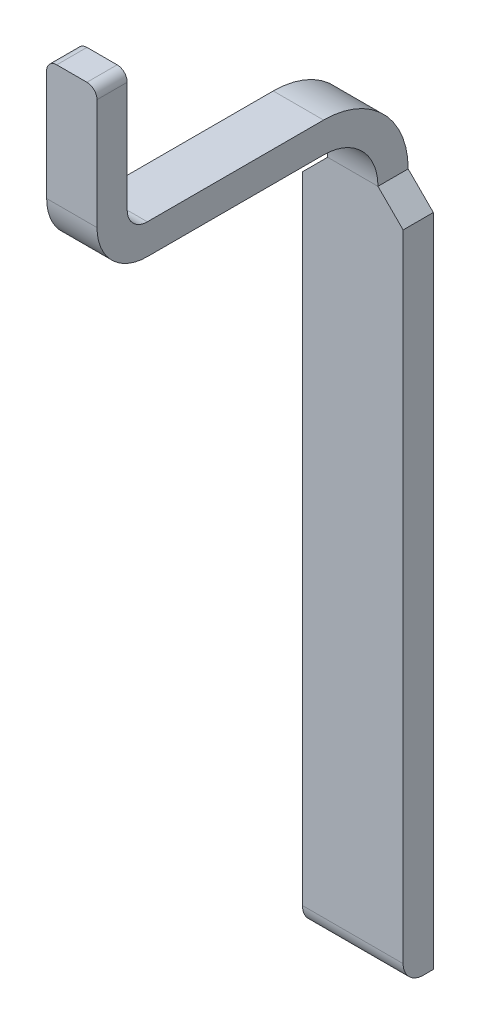
ISO-10303-21;
HEADER;
FILE_DESCRIPTION(('STEP AP214'),'2;1');
FILE_NAME('part.step','',(''),(''),'','','');
FILE_SCHEMA(('AUTOMOTIVE_DESIGN { 1 0 10303 214 1 1 1 1 }'));
ENDSEC;
DATA;
#1=APPLICATION_CONTEXT('core data for automotive mechanical design processes');
#2=APPLICATION_PROTOCOL_DEFINITION('international standard','automotive_design',2000,#1);
#3=PRODUCT_CONTEXT('',#1,'mechanical');
#4=PRODUCT('Part','Part','',(#3));
#5=PRODUCT_RELATED_PRODUCT_CATEGORY('part','',(#4));
#6=PRODUCT_DEFINITION_FORMATION('','',#4);
#7=PRODUCT_DEFINITION_CONTEXT('part definition',#1,'design');
#8=PRODUCT_DEFINITION('design','',#6,#7);
#9=PRODUCT_DEFINITION_SHAPE('','',#8);
#10=(LENGTH_UNIT() NAMED_UNIT(*) SI_UNIT(.MILLI.,.METRE.));
#11=(NAMED_UNIT(*) PLANE_ANGLE_UNIT() SI_UNIT($,.RADIAN.));
#12=(NAMED_UNIT(*) SI_UNIT($,.STERADIAN.) SOLID_ANGLE_UNIT());
#13=UNCERTAINTY_MEASURE_WITH_UNIT(LENGTH_MEASURE(1.E-05),#10,'distance_accuracy_value','');
#14=(GEOMETRIC_REPRESENTATION_CONTEXT(3) GLOBAL_UNCERTAINTY_ASSIGNED_CONTEXT((#13)) GLOBAL_UNIT_ASSIGNED_CONTEXT((#10,
#11,#12)) REPRESENTATION_CONTEXT('',''));
#15=CARTESIAN_POINT('',(0.,0.,0.));
#16=DIRECTION('',(0.,0.,1.));
#17=DIRECTION('',(1.,0.,0.));
#18=AXIS2_PLACEMENT_3D('',#15,#16,#17);
#19=CARTESIAN_POINT('',(0.25,2.03,-0.12));
#20=DIRECTION('',(0.,0.,-1.));
#21=DIRECTION('',(-1.,0.,0.));
#22=AXIS2_PLACEMENT_3D('',#19,#20,#21);
#23=PLANE('',#22);
#24=DIRECTION('',(0.,-1.,0.));
#25=VECTOR('',#24,1.);
#26=CARTESIAN_POINT('',(-0.25,2.03,-0.12));
#27=LINE('',#26,#25);
#28=CARTESIAN_POINT('',(-0.25,1.905,-0.12));
#29=VERTEX_POINT('',#28);
#30=CARTESIAN_POINT('',(-0.25,-1.25,-0.12));
#31=VERTEX_POINT('',#30);
#32=EDGE_CURVE('E11',#29,#31,#27,.T.);
#33=ORIENTED_EDGE('',*,*,#32,.T.);
#34=DIRECTION('',(1.,0.,0.));
#35=VECTOR('',#34,1.);
#36=CARTESIAN_POINT('',(0.25,-1.25,-0.12));
#37=LINE('',#36,#35);
#38=CARTESIAN_POINT('',(0.25,-1.25,-0.12));
#39=VERTEX_POINT('',#38);
#40=EDGE_CURVE('E277',#31,#39,#37,.T.);
#41=ORIENTED_EDGE('',*,*,#40,.T.);
#42=DIRECTION('',(0.,-1.,0.));
#43=VECTOR('',#42,1.);
#44=CARTESIAN_POINT('',(0.25,2.03,-0.12));
#45=LINE('',#44,#43);
#46=CARTESIAN_POINT('',(0.25,1.905,-0.12));
#47=VERTEX_POINT('',#46);
#48=EDGE_CURVE('E27',#47,#39,#45,.T.);
#49=ORIENTED_EDGE('',*,*,#48,.F.);
#50=DIRECTION('',(-0.707106781186547,0.707106781186548,0.));
#51=VECTOR('',#50,1.);
#52=CARTESIAN_POINT('',(0.25,1.905,-0.12));
#53=LINE('',#52,#51);
#54=CARTESIAN_POINT('',(0.125,2.03,-0.12));
#55=VERTEX_POINT('',#54);
#56=EDGE_CURVE('E289',#47,#55,#53,.T.);
#57=ORIENTED_EDGE('',*,*,#56,.T.);
#58=DIRECTION('',(-1.,0.,0.));
#59=VECTOR('',#58,1.);
#60=CARTESIAN_POINT('',(0.25,2.03,-0.12));
#61=LINE('',#60,#59);
#62=CARTESIAN_POINT('',(-0.125,2.03,-0.12));
#63=VERTEX_POINT('',#62);
#64=EDGE_CURVE('E157',#55,#63,#61,.T.);
#65=ORIENTED_EDGE('',*,*,#64,.T.);
#66=DIRECTION('',(-0.707106781186547,-0.707106781186548,0.));
#67=VECTOR('',#66,1.);
#68=CARTESIAN_POINT('',(-0.125,2.03,-0.12));
#69=LINE('',#68,#67);
#70=EDGE_CURVE('E303',#63,#29,#69,.T.);
#71=ORIENTED_EDGE('',*,*,#70,.T.);
#72=EDGE_LOOP('',(#33,#41,#49,#57,#65,#71));
#73=FACE_BOUND('',#72,.T.);
#74=ADVANCED_FACE('F16',(#73),#23,.F.);
#75=CARTESIAN_POINT('',(-0.25,-1.35,-0.27));
#76=DIRECTION('',(1.,0.,0.));
#77=DIRECTION('',(0.,-1.,0.));
#78=AXIS2_PLACEMENT_3D('',#75,#76,#77);
#79=PLANE('',#78);
#80=DIRECTION('',(0.,0.,-1.));
#81=VECTOR('',#80,1.);
#82=CARTESIAN_POINT('',(-0.25,-1.35,-0.12));
#83=LINE('',#82,#81);
#84=CARTESIAN_POINT('',(-0.25,-1.35,-0.22));
#85=VERTEX_POINT('',#84);
#86=CARTESIAN_POINT('',(-0.25,-1.35,-0.27));
#87=VERTEX_POINT('',#86);
#88=EDGE_CURVE('E232',#85,#87,#83,.T.);
#89=ORIENTED_EDGE('',*,*,#88,.F.);
#90=CARTESIAN_POINT('',(-0.25,-1.25,-0.22));
#91=DIRECTION('',(-1.,0.,0.));
#92=DIRECTION('',(0.,1.,0.));
#93=AXIS2_PLACEMENT_3D('',#90,#91,#92);
#94=CIRCLE('',#93,0.1);
#95=EDGE_CURVE('E273',#85,#31,#94,.T.);
#96=ORIENTED_EDGE('',*,*,#95,.T.);
#97=ORIENTED_EDGE('',*,*,#32,.F.);
#98=DIRECTION('',(0.,0.,-1.));
#99=VECTOR('',#98,1.);
#100=CARTESIAN_POINT('',(-0.25,1.905,-0.27));
#101=LINE('',#100,#99);
#102=CARTESIAN_POINT('',(-0.25,1.905,-0.27));
#103=VERTEX_POINT('',#102);
#104=EDGE_CURVE('E264',#29,#103,#101,.T.);
#105=ORIENTED_EDGE('',*,*,#104,.T.);
#106=DIRECTION('',(0.,1.,0.));
#107=VECTOR('',#106,1.);
#108=CARTESIAN_POINT('',(-0.25,-1.35,-0.27));
#109=LINE('',#108,#107);
#110=EDGE_CURVE('E189',#87,#103,#109,.T.);
#111=ORIENTED_EDGE('',*,*,#110,.F.);
#112=EDGE_LOOP('',(#89,#96,#97,#105,#111));
#113=FACE_BOUND('',#112,.T.);
#114=ADVANCED_FACE('F403',(#113),#79,.F.);
#115=CARTESIAN_POINT('',(0.25,-1.35,-0.27));
#116=DIRECTION('',(1.,0.,0.));
#117=DIRECTION('',(0.,-1.,0.));
#118=AXIS2_PLACEMENT_3D('',#115,#116,#117);
#119=PLANE('',#118);
#120=ORIENTED_EDGE('',*,*,#48,.T.);
#121=CARTESIAN_POINT('',(0.25,-1.25,-0.22));
#122=DIRECTION('',(1.,0.,0.));
#123=DIRECTION('',(0.,1.,0.));
#124=AXIS2_PLACEMENT_3D('',#121,#122,#123);
#125=CIRCLE('',#124,0.1);
#126=CARTESIAN_POINT('',(0.25,-1.35,-0.22));
#127=VERTEX_POINT('',#126);
#128=EDGE_CURVE('E299',#39,#127,#125,.T.);
#129=ORIENTED_EDGE('',*,*,#128,.T.);
#130=DIRECTION('',(0.,0.,-1.));
#131=VECTOR('',#130,1.);
#132=CARTESIAN_POINT('',(0.25,-1.35,-0.12));
#133=LINE('',#132,#131);
#134=CARTESIAN_POINT('',(0.25,-1.35,-0.27));
#135=VERTEX_POINT('',#134);
#136=EDGE_CURVE('E227',#127,#135,#133,.T.);
#137=ORIENTED_EDGE('',*,*,#136,.T.);
#138=DIRECTION('',(0.,1.,0.));
#139=VECTOR('',#138,1.);
#140=CARTESIAN_POINT('',(0.25,-1.35,-0.27));
#141=LINE('',#140,#139);
#142=CARTESIAN_POINT('',(0.25,1.905,-0.27));
#143=VERTEX_POINT('',#142);
#144=EDGE_CURVE('E260',#135,#143,#141,.T.);
#145=ORIENTED_EDGE('',*,*,#144,.T.);
#146=DIRECTION('',(0.,0.,1.));
#147=VECTOR('',#146,1.);
#148=CARTESIAN_POINT('',(0.25,1.905,-0.12));
#149=LINE('',#148,#147);
#150=EDGE_CURVE('E285',#143,#47,#149,.T.);
#151=ORIENTED_EDGE('',*,*,#150,.T.);
#152=EDGE_LOOP('',(#120,#129,#137,#145,#151));
#153=FACE_BOUND('',#152,.T.);
#154=ADVANCED_FACE('F377',(#153),#119,.T.);
#155=CARTESIAN_POINT('',(0.125,2.03,0.15));
#156=DIRECTION('',(1.,0.,0.));
#157=DIRECTION('',(0.,0.,1.));
#158=AXIS2_PLACEMENT_3D('',#155,#156,#157);
#159=CYLINDRICAL_SURFACE('',#158,0.27);
#160=CARTESIAN_POINT('',(-0.125,2.03,0.15));
#161=DIRECTION('',(1.,0.,0.));
#162=DIRECTION('',(0.,-1.,0.));
#163=AXIS2_PLACEMENT_3D('',#160,#161,#162);
#164=CIRCLE('',#163,0.27);
#165=CARTESIAN_POINT('',(-0.125,2.3,0.15));
#166=VERTEX_POINT('',#165);
#167=EDGE_CURVE('E149',#63,#166,#164,.T.);
#168=ORIENTED_EDGE('',*,*,#167,.F.);
#169=ORIENTED_EDGE('',*,*,#64,.F.);
#170=CARTESIAN_POINT('',(0.125,2.03,0.15));
#171=DIRECTION('',(1.,0.,0.));
#172=DIRECTION('',(0.,-1.,0.));
#173=AXIS2_PLACEMENT_3D('',#170,#171,#172);
#174=CIRCLE('',#173,0.27);
#175=CARTESIAN_POINT('',(0.125,2.3,0.15));
#176=VERTEX_POINT('',#175);
#177=EDGE_CURVE('E152',#55,#176,#174,.T.);
#178=ORIENTED_EDGE('',*,*,#177,.T.);
#179=DIRECTION('',(-1.,0.,0.));
#180=VECTOR('',#179,1.);
#181=CARTESIAN_POINT('',(0.125,2.3,0.15));
#182=LINE('',#181,#180);
#183=EDGE_CURVE('E144',#176,#166,#182,.T.);
#184=ORIENTED_EDGE('',*,*,#183,.T.);
#185=EDGE_LOOP('',(#168,#169,#178,#184));
#186=FACE_BOUND('',#185,.T.);
#187=ADVANCED_FACE('F146',(#186),#159,.F.);
#188=CARTESIAN_POINT('',(0.125,2.3,0.15));
#189=DIRECTION('',(0.,-1.,0.));
#190=DIRECTION('',(0.,0.,-1.));
#191=AXIS2_PLACEMENT_3D('',#188,#189,#190);
#192=PLANE('',#191);
#193=DIRECTION('',(0.,0.,1.));
#194=VECTOR('',#193,1.);
#195=CARTESIAN_POINT('',(-0.125,2.3,0.15));
#196=LINE('',#195,#194);
#197=CARTESIAN_POINT('',(-0.125,2.3,1.025));
#198=VERTEX_POINT('',#197);
#199=EDGE_CURVE('E161',#166,#198,#196,.T.);
#200=ORIENTED_EDGE('',*,*,#199,.F.);
#201=ORIENTED_EDGE('',*,*,#183,.F.);
#202=DIRECTION('',(0.,0.,1.));
#203=VECTOR('',#202,1.);
#204=CARTESIAN_POINT('',(0.125,2.3,0.15));
#205=LINE('',#204,#203);
#206=CARTESIAN_POINT('',(0.125,2.3,1.025));
#207=VERTEX_POINT('',#206);
#208=EDGE_CURVE('E284',#176,#207,#205,.T.);
#209=ORIENTED_EDGE('',*,*,#208,.T.);
#210=DIRECTION('',(-1.,0.,0.));
#211=VECTOR('',#210,1.);
#212=CARTESIAN_POINT('',(0.125,2.3,1.025));
#213=LINE('',#212,#211);
#214=EDGE_CURVE('E158',#207,#198,#213,.T.);
#215=ORIENTED_EDGE('',*,*,#214,.T.);
#216=EDGE_LOOP('',(#200,#201,#209,#215));
#217=FACE_BOUND('',#216,.T.);
#218=ADVANCED_FACE('F162',(#217),#192,.T.);
#219=CARTESIAN_POINT('',(0.125,2.55,1.025));
#220=DIRECTION('',(1.,0.,0.));
#221=DIRECTION('',(0.,0.,1.));
#222=AXIS2_PLACEMENT_3D('',#219,#220,#221);
#223=CYLINDRICAL_SURFACE('',#222,0.25);
#224=CARTESIAN_POINT('',(-0.125,2.55,1.025));
#225=DIRECTION('',(-1.,0.,0.));
#226=DIRECTION('',(0.,1.,0.));
#227=AXIS2_PLACEMENT_3D('',#224,#225,#226);
#228=CIRCLE('',#227,0.25);
#229=CARTESIAN_POINT('',(-0.125,2.55,1.275));
#230=VERTEX_POINT('',#229);
#231=EDGE_CURVE('E167',#198,#230,#228,.T.);
#232=ORIENTED_EDGE('',*,*,#231,.F.);
#233=ORIENTED_EDGE('',*,*,#214,.F.);
#234=CARTESIAN_POINT('',(0.125,2.55,1.025));
#235=DIRECTION('',(-1.,0.,0.));
#236=DIRECTION('',(0.,1.,0.));
#237=AXIS2_PLACEMENT_3D('',#234,#235,#236);
#238=CIRCLE('',#237,0.25);
#239=CARTESIAN_POINT('',(0.125,2.55,1.275));
#240=VERTEX_POINT('',#239);
#241=EDGE_CURVE('E241',#207,#240,#238,.T.);
#242=ORIENTED_EDGE('',*,*,#241,.T.);
#243=DIRECTION('',(-1.,0.,0.));
#244=VECTOR('',#243,1.);
#245=CARTESIAN_POINT('',(0.125,2.55,1.275));
#246=LINE('',#245,#244);
#247=EDGE_CURVE('E245',#240,#230,#246,.T.);
#248=ORIENTED_EDGE('',*,*,#247,.T.);
#249=EDGE_LOOP('',(#232,#233,#242,#248));
#250=FACE_BOUND('',#249,.T.);
#251=ADVANCED_FACE('F595',(#250),#223,.T.);
#252=CARTESIAN_POINT('',(0.125,2.55,1.275));
#253=DIRECTION('',(0.,0.,1.));
#254=DIRECTION('',(0.,-1.,0.));
#255=AXIS2_PLACEMENT_3D('',#252,#253,#254);
#256=PLANE('',#255);
#257=DIRECTION('',(0.,1.,0.));
#258=VECTOR('',#257,1.);
#259=CARTESIAN_POINT('',(0.125,2.55,1.275));
#260=LINE('',#259,#258);
#261=CARTESIAN_POINT('',(0.125,3.1,1.275));
#262=VERTEX_POINT('',#261);
#263=EDGE_CURVE('E238',#240,#262,#260,.T.);
#264=ORIENTED_EDGE('',*,*,#263,.T.);
#265=CARTESIAN_POINT('',(0.075,3.1,1.275));
#266=DIRECTION('',(0.,0.,1.));
#267=DIRECTION('',(0.,-1.,0.));
#268=AXIS2_PLACEMENT_3D('',#265,#266,#267);
#269=CIRCLE('',#268,0.05);
#270=CARTESIAN_POINT('',(0.075,3.15,1.275));
#271=VERTEX_POINT('',#270);
#272=EDGE_CURVE('E233',#262,#271,#269,.T.);
#273=ORIENTED_EDGE('',*,*,#272,.T.);
#274=DIRECTION('',(-1.,0.,0.));
#275=VECTOR('',#274,1.);
#276=CARTESIAN_POINT('',(0.125,3.15,1.275));
#277=LINE('',#276,#275);
#278=CARTESIAN_POINT('',(-0.075,3.15,1.275));
#279=VERTEX_POINT('',#278);
#280=EDGE_CURVE('E222',#271,#279,#277,.T.);
#281=ORIENTED_EDGE('',*,*,#280,.T.);
#282=CARTESIAN_POINT('',(-0.075,3.1,1.275));
#283=DIRECTION('',(0.,0.,1.));
#284=DIRECTION('',(0.,-1.,0.));
#285=AXIS2_PLACEMENT_3D('',#282,#283,#284);
#286=CIRCLE('',#285,0.05);
#287=CARTESIAN_POINT('',(-0.125,3.1,1.275));
#288=VERTEX_POINT('',#287);
#289=EDGE_CURVE('E218',#279,#288,#286,.T.);
#290=ORIENTED_EDGE('',*,*,#289,.T.);
#291=DIRECTION('',(0.,1.,0.));
#292=VECTOR('',#291,1.);
#293=CARTESIAN_POINT('',(-0.125,2.55,1.275));
#294=LINE('',#293,#292);
#295=EDGE_CURVE('E197',#230,#288,#294,.T.);
#296=ORIENTED_EDGE('',*,*,#295,.F.);
#297=ORIENTED_EDGE('',*,*,#247,.F.);
#298=EDGE_LOOP('',(#264,#273,#281,#290,#296,#297));
#299=FACE_BOUND('',#298,.T.);
#300=ADVANCED_FACE('F587',(#299),#256,.T.);
#301=CARTESIAN_POINT('',(0.125,3.15,1.275));
#302=DIRECTION('',(0.,1.,0.));
#303=DIRECTION('',(1.,0.,0.));
#304=AXIS2_PLACEMENT_3D('',#301,#302,#303);
#305=PLANE('',#304);
#306=ORIENTED_EDGE('',*,*,#280,.F.);
#307=DIRECTION('',(0.,0.,-1.));
#308=VECTOR('',#307,1.);
#309=CARTESIAN_POINT('',(0.075,3.15,1.275));
#310=LINE('',#309,#308);
#311=CARTESIAN_POINT('',(0.075,3.15,1.125));
#312=VERTEX_POINT('',#311);
#313=EDGE_CURVE('E224',#271,#312,#310,.T.);
#314=ORIENTED_EDGE('',*,*,#313,.T.);
#315=DIRECTION('',(-1.,0.,0.));
#316=VECTOR('',#315,1.);
#317=CARTESIAN_POINT('',(0.125,3.15,1.125));
#318=LINE('',#317,#316);
#319=CARTESIAN_POINT('',(-0.075,3.15,1.125));
#320=VERTEX_POINT('',#319);
#321=EDGE_CURVE('E328',#312,#320,#318,.T.);
#322=ORIENTED_EDGE('',*,*,#321,.T.);
#323=DIRECTION('',(0.,0.,1.));
#324=VECTOR('',#323,1.);
#325=CARTESIAN_POINT('',(-0.075,3.15,1.275));
#326=LINE('',#325,#324);
#327=EDGE_CURVE('E209',#320,#279,#326,.T.);
#328=ORIENTED_EDGE('',*,*,#327,.T.);
#329=EDGE_LOOP('',(#306,#314,#322,#328));
#330=FACE_BOUND('',#329,.T.);
#331=ADVANCED_FACE('F580',(#330),#305,.T.);
#332=CARTESIAN_POINT('',(0.125,2.55,1.125));
#333=DIRECTION('',(0.,0.,-1.));
#334=DIRECTION('',(0.,-1.,0.));
#335=AXIS2_PLACEMENT_3D('',#332,#333,#334);
#336=PLANE('',#335);
#337=ORIENTED_EDGE('',*,*,#321,.F.);
#338=CARTESIAN_POINT('',(0.075,3.1,1.125));
#339=DIRECTION('',(0.,0.,-1.));
#340=DIRECTION('',(0.,1.,0.));
#341=AXIS2_PLACEMENT_3D('',#338,#339,#340);
#342=CIRCLE('',#341,0.05);
#343=CARTESIAN_POINT('',(0.125,3.1,1.125));
#344=VERTEX_POINT('',#343);
#345=EDGE_CURVE('E228',#312,#344,#342,.T.);
#346=ORIENTED_EDGE('',*,*,#345,.T.);
#347=DIRECTION('',(0.,-1.,0.));
#348=VECTOR('',#347,1.);
#349=CARTESIAN_POINT('',(0.125,2.55,1.125));
#350=LINE('',#349,#348);
#351=CARTESIAN_POINT('',(0.125,2.55,1.125));
#352=VERTEX_POINT('',#351);
#353=EDGE_CURVE('E242',#344,#352,#350,.T.);
#354=ORIENTED_EDGE('',*,*,#353,.T.);
#355=DIRECTION('',(-1.,0.,0.));
#356=VECTOR('',#355,1.);
#357=CARTESIAN_POINT('',(0.125,2.55,1.125));
#358=LINE('',#357,#356);
#359=CARTESIAN_POINT('',(-0.125,2.55,1.125));
#360=VERTEX_POINT('',#359);
#361=EDGE_CURVE('E314',#352,#360,#358,.T.);
#362=ORIENTED_EDGE('',*,*,#361,.T.);
#363=DIRECTION('',(0.,-1.,0.));
#364=VECTOR('',#363,1.);
#365=CARTESIAN_POINT('',(-0.125,2.55,1.125));
#366=LINE('',#365,#364);
#367=CARTESIAN_POINT('',(-0.125,3.1,1.125));
#368=VERTEX_POINT('',#367);
#369=EDGE_CURVE('E205',#368,#360,#366,.T.);
#370=ORIENTED_EDGE('',*,*,#369,.F.);
#371=CARTESIAN_POINT('',(-0.075,3.1,1.125));
#372=DIRECTION('',(0.,0.,-1.));
#373=DIRECTION('',(0.,1.,0.));
#374=AXIS2_PLACEMENT_3D('',#371,#372,#373);
#375=CIRCLE('',#374,0.05);
#376=EDGE_CURVE('E198',#368,#320,#375,.T.);
#377=ORIENTED_EDGE('',*,*,#376,.T.);
#378=EDGE_LOOP('',(#337,#346,#354,#362,#370,#377));
#379=FACE_BOUND('',#378,.T.);
#380=ADVANCED_FACE('F573',(#379),#336,.T.);
#381=CARTESIAN_POINT('',(0.125,2.55,1.025));
#382=DIRECTION('',(1.,0.,0.));
#383=DIRECTION('',(0.,0.,1.));
#384=AXIS2_PLACEMENT_3D('',#381,#382,#383);
#385=CYLINDRICAL_SURFACE('',#384,0.1);
#386=CARTESIAN_POINT('',(-0.125,2.55,1.025));
#387=DIRECTION('',(1.,0.,0.));
#388=DIRECTION('',(0.,1.,0.));
#389=AXIS2_PLACEMENT_3D('',#386,#387,#388);
#390=CIRCLE('',#389,0.1);
#391=CARTESIAN_POINT('',(-0.125,2.45,1.025));
#392=VERTEX_POINT('',#391);
#393=EDGE_CURVE('E251',#360,#392,#390,.T.);
#394=ORIENTED_EDGE('',*,*,#393,.F.);
#395=ORIENTED_EDGE('',*,*,#361,.F.);
#396=CARTESIAN_POINT('',(0.125,2.55,1.025));
#397=DIRECTION('',(1.,0.,0.));
#398=DIRECTION('',(0.,1.,0.));
#399=AXIS2_PLACEMENT_3D('',#396,#397,#398);
#400=CIRCLE('',#399,0.1);
#401=CARTESIAN_POINT('',(0.125,2.45,1.025));
#402=VERTEX_POINT('',#401);
#403=EDGE_CURVE('E255',#352,#402,#400,.T.);
#404=ORIENTED_EDGE('',*,*,#403,.T.);
#405=DIRECTION('',(-1.,0.,0.));
#406=VECTOR('',#405,1.);
#407=CARTESIAN_POINT('',(0.125,2.45,1.025));
#408=LINE('',#407,#406);
#409=EDGE_CURVE('E41',#402,#392,#408,.T.);
#410=ORIENTED_EDGE('',*,*,#409,.T.);
#411=EDGE_LOOP('',(#394,#395,#404,#410));
#412=FACE_BOUND('',#411,.T.);
#413=ADVANCED_FACE('F18',(#412),#385,.F.);
#414=CARTESIAN_POINT('',(0.125,2.45,0.15));
#415=DIRECTION('',(0.,1.,0.));
#416=DIRECTION('',(1.,0.,0.));
#417=AXIS2_PLACEMENT_3D('',#414,#415,#416);
#418=PLANE('',#417);
#419=DIRECTION('',(0.,0.,-1.));
#420=VECTOR('',#419,1.);
#421=CARTESIAN_POINT('',(-0.125,2.45,0.15));
#422=LINE('',#421,#420);
#423=CARTESIAN_POINT('',(-0.125,2.45,0.15));
#424=VERTEX_POINT('',#423);
#425=EDGE_CURVE('E180',#392,#424,#422,.T.);
#426=ORIENTED_EDGE('',*,*,#425,.F.);
#427=ORIENTED_EDGE('',*,*,#409,.F.);
#428=DIRECTION('',(0.,0.,-1.));
#429=VECTOR('',#428,1.);
#430=CARTESIAN_POINT('',(0.125,2.45,0.15));
#431=LINE('',#430,#429);
#432=CARTESIAN_POINT('',(0.125,2.45,0.15));
#433=VERTEX_POINT('',#432);
#434=EDGE_CURVE('E252',#402,#433,#431,.T.);
#435=ORIENTED_EDGE('',*,*,#434,.T.);
#436=DIRECTION('',(-1.,0.,0.));
#437=VECTOR('',#436,1.);
#438=CARTESIAN_POINT('',(0.125,2.45,0.15));
#439=LINE('',#438,#437);
#440=EDGE_CURVE('E292',#433,#424,#439,.T.);
#441=ORIENTED_EDGE('',*,*,#440,.T.);
#442=EDGE_LOOP('',(#426,#427,#435,#441));
#443=FACE_BOUND('',#442,.T.);
#444=ADVANCED_FACE('F561',(#443),#418,.T.);
#445=CARTESIAN_POINT('',(0.125,2.03,0.15));
#446=DIRECTION('',(1.,0.,0.));
#447=DIRECTION('',(0.,-1.,0.));
#448=AXIS2_PLACEMENT_3D('',#445,#446,#447);
#449=PLANE('',#448);
#450=ORIENTED_EDGE('',*,*,#353,.F.);
#451=DIRECTION('',(0.,0.,1.));
#452=VECTOR('',#451,1.);
#453=CARTESIAN_POINT('',(0.125,3.1,0.15));
#454=LINE('',#453,#452);
#455=EDGE_CURVE('E20',#344,#262,#454,.T.);
#456=ORIENTED_EDGE('',*,*,#455,.T.);
#457=ORIENTED_EDGE('',*,*,#263,.F.);
#458=ORIENTED_EDGE('',*,*,#241,.F.);
#459=ORIENTED_EDGE('',*,*,#208,.F.);
#460=ORIENTED_EDGE('',*,*,#177,.F.);
#461=DIRECTION('',(0.,0.,-1.));
#462=VECTOR('',#461,1.);
#463=CARTESIAN_POINT('',(0.125,2.03,-0.27));
#464=LINE('',#463,#462);
#465=CARTESIAN_POINT('',(0.125,2.03,-0.27));
#466=VERTEX_POINT('',#465);
#467=EDGE_CURVE('E184',#55,#466,#464,.T.);
#468=ORIENTED_EDGE('',*,*,#467,.T.);
#469=CARTESIAN_POINT('',(0.125,2.03,0.15));
#470=DIRECTION('',(-1.,0.,0.));
#471=DIRECTION('',(0.,-1.,0.));
#472=AXIS2_PLACEMENT_3D('',#469,#470,#471);
#473=CIRCLE('',#472,0.42);
#474=EDGE_CURVE('E295',#433,#466,#473,.T.);
#475=ORIENTED_EDGE('',*,*,#474,.F.);
#476=ORIENTED_EDGE('',*,*,#434,.F.);
#477=ORIENTED_EDGE('',*,*,#403,.F.);
#478=EDGE_LOOP('',(#450,#456,#457,#458,#459,#460,#468,#475,#476,#477));
#479=FACE_BOUND('',#478,.T.);
#480=ADVANCED_FACE('F353',(#479),#449,.T.);
#481=CARTESIAN_POINT('',(0.125,2.03,0.15));
#482=DIRECTION('',(1.,0.,0.));
#483=DIRECTION('',(0.,0.,1.));
#484=AXIS2_PLACEMENT_3D('',#481,#482,#483);
#485=CYLINDRICAL_SURFACE('',#484,0.42);
#486=CARTESIAN_POINT('',(-0.125,2.03,0.15));
#487=DIRECTION('',(-1.,0.,0.));
#488=DIRECTION('',(0.,-1.,0.));
#489=AXIS2_PLACEMENT_3D('',#486,#487,#488);
#490=CIRCLE('',#489,0.42);
#491=CARTESIAN_POINT('',(-0.125,2.03,-0.27));
#492=VERTEX_POINT('',#491);
#493=EDGE_CURVE('E174',#424,#492,#490,.T.);
#494=ORIENTED_EDGE('',*,*,#493,.F.);
#495=ORIENTED_EDGE('',*,*,#440,.F.);
#496=ORIENTED_EDGE('',*,*,#474,.T.);
#497=DIRECTION('',(-1.,0.,0.));
#498=VECTOR('',#497,1.);
#499=CARTESIAN_POINT('',(0.25,2.03,-0.27));
#500=LINE('',#499,#498);
#501=EDGE_CURVE('E188',#466,#492,#500,.T.);
#502=ORIENTED_EDGE('',*,*,#501,.T.);
#503=EDGE_LOOP('',(#494,#495,#496,#502));
#504=FACE_BOUND('',#503,.T.);
#505=ADVANCED_FACE('F366',(#504),#485,.T.);
#506=CARTESIAN_POINT('',(-0.125,2.03,0.15));
#507=DIRECTION('',(1.,0.,0.));
#508=DIRECTION('',(0.,-1.,0.));
#509=AXIS2_PLACEMENT_3D('',#506,#507,#508);
#510=PLANE('',#509);
#511=ORIENTED_EDGE('',*,*,#295,.T.);
#512=DIRECTION('',(0.,0.,-1.));
#513=VECTOR('',#512,1.);
#514=CARTESIAN_POINT('',(-0.125,3.1,1.125));
#515=LINE('',#514,#513);
#516=EDGE_CURVE('E194',#288,#368,#515,.T.);
#517=ORIENTED_EDGE('',*,*,#516,.T.);
#518=ORIENTED_EDGE('',*,*,#369,.T.);
#519=ORIENTED_EDGE('',*,*,#393,.T.);
#520=ORIENTED_EDGE('',*,*,#425,.T.);
#521=ORIENTED_EDGE('',*,*,#493,.T.);
#522=DIRECTION('',(0.,0.,1.));
#523=VECTOR('',#522,1.);
#524=CARTESIAN_POINT('',(-0.125,2.03,-0.27));
#525=LINE('',#524,#523);
#526=EDGE_CURVE('E171',#492,#63,#525,.T.);
#527=ORIENTED_EDGE('',*,*,#526,.T.);
#528=ORIENTED_EDGE('',*,*,#167,.T.);
#529=ORIENTED_EDGE('',*,*,#199,.T.);
#530=ORIENTED_EDGE('',*,*,#231,.T.);
#531=EDGE_LOOP('',(#511,#517,#518,#519,#520,#521,#527,#528,#529,#530));
#532=FACE_BOUND('',#531,.T.);
#533=ADVANCED_FACE('F169',(#532),#510,.F.);
#534=CARTESIAN_POINT('',(-0.075,3.1,0.15));
#535=DIRECTION('',(0.,0.,-1.));
#536=DIRECTION('',(1.,0.,0.));
#537=AXIS2_PLACEMENT_3D('',#534,#535,#536);
#538=CYLINDRICAL_SURFACE('',#537,0.05);
#539=ORIENTED_EDGE('',*,*,#289,.F.);
#540=ORIENTED_EDGE('',*,*,#327,.F.);
#541=ORIENTED_EDGE('',*,*,#376,.F.);
#542=ORIENTED_EDGE('',*,*,#516,.F.);
#543=EDGE_LOOP('',(#539,#540,#541,#542));
#544=FACE_BOUND('',#543,.T.);
#545=ADVANCED_FACE('F473',(#544),#538,.T.);
#546=CARTESIAN_POINT('',(0.25,1.905,-0.27));
#547=DIRECTION('',(0.707106781186548,0.707106781186547,0.));
#548=DIRECTION('',(0.,0.,-1.));
#549=AXIS2_PLACEMENT_3D('',#546,#547,#548);
#550=PLANE('',#549);
#551=DIRECTION('',(0.707106781186547,-0.707106781186548,0.));
#552=VECTOR('',#551,1.);
#553=CARTESIAN_POINT('',(0.25,1.905,-0.27));
#554=LINE('',#553,#552);
#555=EDGE_CURVE('E259',#466,#143,#554,.T.);
#556=ORIENTED_EDGE('',*,*,#555,.F.);
#557=ORIENTED_EDGE('',*,*,#467,.F.);
#558=ORIENTED_EDGE('',*,*,#56,.F.);
#559=ORIENTED_EDGE('',*,*,#150,.F.);
#560=EDGE_LOOP('',(#556,#557,#558,#559));
#561=FACE_BOUND('',#560,.T.);
#562=ADVANCED_FACE('F360',(#561),#550,.T.);
#563=CARTESIAN_POINT('',(-0.125,2.03,-0.27));
#564=DIRECTION('',(0.707106781186548,-0.707106781186547,0.));
#565=DIRECTION('',(0.,0.,-1.));
#566=AXIS2_PLACEMENT_3D('',#563,#564,#565);
#567=PLANE('',#566);
#568=DIRECTION('',(0.707106781186547,0.707106781186548,0.));
#569=VECTOR('',#568,1.);
#570=CARTESIAN_POINT('',(-0.125,2.03,-0.27));
#571=LINE('',#570,#569);
#572=EDGE_CURVE('E186',#103,#492,#571,.T.);
#573=ORIENTED_EDGE('',*,*,#572,.F.);
#574=ORIENTED_EDGE('',*,*,#104,.F.);
#575=ORIENTED_EDGE('',*,*,#70,.F.);
#576=ORIENTED_EDGE('',*,*,#526,.F.);
#577=EDGE_LOOP('',(#573,#574,#575,#576));
#578=FACE_BOUND('',#577,.T.);
#579=ADVANCED_FACE('F402',(#578),#567,.F.);
#580=CARTESIAN_POINT('',(0.25,-1.35,-0.27));
#581=DIRECTION('',(0.,0.,1.));
#582=DIRECTION('',(0.,-1.,0.));
#583=AXIS2_PLACEMENT_3D('',#580,#581,#582);
#584=PLANE('',#583);
#585=ORIENTED_EDGE('',*,*,#110,.T.);
#586=ORIENTED_EDGE('',*,*,#572,.T.);
#587=ORIENTED_EDGE('',*,*,#501,.F.);
#588=ORIENTED_EDGE('',*,*,#555,.T.);
#589=ORIENTED_EDGE('',*,*,#144,.F.);
#590=DIRECTION('',(-1.,0.,0.));
#591=VECTOR('',#590,1.);
#592=CARTESIAN_POINT('',(0.25,-1.35,-0.27));
#593=LINE('',#592,#591);
#594=EDGE_CURVE('E193',#135,#87,#593,.T.);
#595=ORIENTED_EDGE('',*,*,#594,.T.);
#596=EDGE_LOOP('',(#585,#586,#587,#588,#589,#595));
#597=FACE_BOUND('',#596,.T.);
#598=ADVANCED_FACE('F362',(#597),#584,.F.);
#599=CARTESIAN_POINT('',(0.25,-1.35,-0.12));
#600=DIRECTION('',(0.,1.,0.));
#601=DIRECTION('',(1.,0.,0.));
#602=AXIS2_PLACEMENT_3D('',#599,#600,#601);
#603=PLANE('',#602);
#604=ORIENTED_EDGE('',*,*,#136,.F.);
#605=DIRECTION('',(-1.,0.,0.));
#606=VECTOR('',#605,1.);
#607=CARTESIAN_POINT('',(0.25,-1.35,-0.22));
#608=LINE('',#607,#606);
#609=EDGE_CURVE('E237',#127,#85,#608,.T.);
#610=ORIENTED_EDGE('',*,*,#609,.T.);
#611=ORIENTED_EDGE('',*,*,#88,.T.);
#612=ORIENTED_EDGE('',*,*,#594,.F.);
#613=EDGE_LOOP('',(#604,#610,#611,#612));
#614=FACE_BOUND('',#613,.T.);
#615=ADVANCED_FACE('F388',(#614),#603,.F.);
#616=CARTESIAN_POINT('',(0.075,3.1,1.275));
#617=DIRECTION('',(0.,0.,1.));
#618=DIRECTION('',(-1.,0.,0.));
#619=AXIS2_PLACEMENT_3D('',#616,#617,#618);
#620=CYLINDRICAL_SURFACE('',#619,0.05);
#621=ORIENTED_EDGE('',*,*,#272,.F.);
#622=ORIENTED_EDGE('',*,*,#455,.F.);
#623=ORIENTED_EDGE('',*,*,#345,.F.);
#624=ORIENTED_EDGE('',*,*,#313,.F.);
#625=EDGE_LOOP('',(#621,#622,#623,#624));
#626=FACE_BOUND('',#625,.T.);
#627=ADVANCED_FACE('F506',(#626),#620,.T.);
#628=CARTESIAN_POINT('',(0.25,-1.25,-0.22));
#629=DIRECTION('',(1.,0.,0.));
#630=DIRECTION('',(0.,0.,1.));
#631=AXIS2_PLACEMENT_3D('',#628,#629,#630);
#632=CYLINDRICAL_SURFACE('',#631,0.1);
#633=ORIENTED_EDGE('',*,*,#128,.F.);
#634=ORIENTED_EDGE('',*,*,#40,.F.);
#635=ORIENTED_EDGE('',*,*,#95,.F.);
#636=ORIENTED_EDGE('',*,*,#609,.F.);
#637=EDGE_LOOP('',(#633,#634,#635,#636));
#638=FACE_BOUND('',#637,.T.);
#639=ADVANCED_FACE('F386',(#638),#632,.T.);
#640=CLOSED_SHELL('',(#74,#114,#154,#187,#218,#251,#300,#331,#380,#413,#444,#480,#505,#533,#545,
#562,#579,#598,#615,#627,#639));
#641=MANIFOLD_SOLID_BREP('B1',#640);
#642=ADVANCED_BREP_SHAPE_REPRESENTATION('',(#18,#641),#14);
#643=SHAPE_DEFINITION_REPRESENTATION(#9,#642);
ENDSEC;
END-ISO-10303-21;
